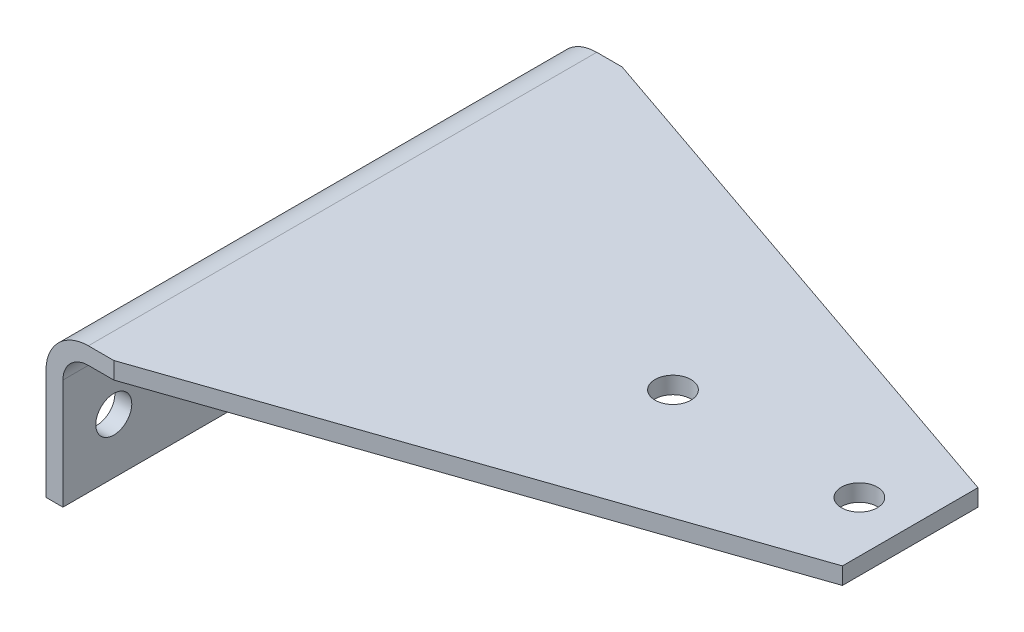
ISO-10303-21;
HEADER;
FILE_DESCRIPTION(('STEP AP214'),'2;1');
FILE_NAME('part.step','',(''),(''),'','','');
FILE_SCHEMA(('AUTOMOTIVE_DESIGN { 1 0 10303 214 1 1 1 1 }'));
ENDSEC;
DATA;
#1=APPLICATION_CONTEXT('core data for automotive mechanical design processes');
#2=APPLICATION_PROTOCOL_DEFINITION('international standard','automotive_design',2000,#1);
#3=PRODUCT_CONTEXT('',#1,'mechanical');
#4=PRODUCT('Part','Part','',(#3));
#5=PRODUCT_RELATED_PRODUCT_CATEGORY('part','',(#4));
#6=PRODUCT_DEFINITION_FORMATION('','',#4);
#7=PRODUCT_DEFINITION_CONTEXT('part definition',#1,'design');
#8=PRODUCT_DEFINITION('design','',#6,#7);
#9=PRODUCT_DEFINITION_SHAPE('','',#8);
#10=(LENGTH_UNIT() NAMED_UNIT(*) SI_UNIT(.MILLI.,.METRE.));
#11=(NAMED_UNIT(*) PLANE_ANGLE_UNIT() SI_UNIT($,.RADIAN.));
#12=(NAMED_UNIT(*) SI_UNIT($,.STERADIAN.) SOLID_ANGLE_UNIT());
#13=UNCERTAINTY_MEASURE_WITH_UNIT(LENGTH_MEASURE(1.E-05),#10,'distance_accuracy_value','');
#14=(GEOMETRIC_REPRESENTATION_CONTEXT(3) GLOBAL_UNCERTAINTY_ASSIGNED_CONTEXT((#13)) GLOBAL_UNIT_ASSIGNED_CONTEXT((#10,
#11,#12)) REPRESENTATION_CONTEXT('',''));
#15=CARTESIAN_POINT('',(0.,0.,0.));
#16=DIRECTION('',(0.,0.,1.));
#17=DIRECTION('',(1.,0.,0.));
#18=AXIS2_PLACEMENT_3D('',#15,#16,#17);
#19=CARTESIAN_POINT('',(6.34999999999998,-57.15,-95.25));
#20=DIRECTION('',(1.,0.,0.));
#21=DIRECTION('',(0.,1.,0.));
#22=AXIS2_PLACEMENT_3D('',#19,#20,#21);
#23=PLANE('',#22);
#24=CARTESIAN_POINT('',(6.34999999999997,-36.5125,-76.2));
#25=DIRECTION('',(1.,0.,0.));
#26=DIRECTION('',(0.,1.,0.));
#27=AXIS2_PLACEMENT_3D('',#24,#25,#26);
#28=CIRCLE('',#27,6.74687500000001);
#29=CARTESIAN_POINT('',(6.34999999999997,-29.765625,-76.2));
#30=VERTEX_POINT('',#29);
#31=EDGE_CURVE('E153',#30,#30,#28,.F.);
#32=ORIENTED_EDGE('',*,*,#31,.T.);
#33=EDGE_LOOP('',(#32));
#34=FACE_BOUND('',#33,.T.);
#35=DIRECTION('',(0.,1.,0.));
#36=VECTOR('',#35,1.);
#37=CARTESIAN_POINT('',(6.34999999999998,-57.15,95.25));
#38=LINE('',#37,#36);
#39=CARTESIAN_POINT('',(6.34999999999998,-57.15,95.25));
#40=VERTEX_POINT('',#39);
#41=CARTESIAN_POINT('',(6.34999999999999,-15.875,95.25));
#42=VERTEX_POINT('',#41);
#43=EDGE_CURVE('E172',#40,#42,#38,.T.);
#44=ORIENTED_EDGE('',*,*,#43,.F.);
#45=DIRECTION('',(0.,0.,1.));
#46=VECTOR('',#45,1.);
#47=CARTESIAN_POINT('',(6.34999999999998,-57.15,-95.25));
#48=LINE('',#47,#46);
#49=CARTESIAN_POINT('',(6.34999999999998,-57.15,-95.25));
#50=VERTEX_POINT('',#49);
#51=EDGE_CURVE('E202',#50,#40,#48,.T.);
#52=ORIENTED_EDGE('',*,*,#51,.F.);
#53=DIRECTION('',(0.,1.,0.));
#54=VECTOR('',#53,1.);
#55=CARTESIAN_POINT('',(6.34999999999998,-57.15,-95.25));
#56=LINE('',#55,#54);
#57=CARTESIAN_POINT('',(6.34999999999999,-15.875,-95.25));
#58=VERTEX_POINT('',#57);
#59=EDGE_CURVE('E192',#50,#58,#56,.T.);
#60=ORIENTED_EDGE('',*,*,#59,.T.);
#61=DIRECTION('',(0.,0.,1.));
#62=VECTOR('',#61,1.);
#63=CARTESIAN_POINT('',(6.34999999999999,-15.875,-95.25));
#64=LINE('',#63,#62);
#65=EDGE_CURVE('E200',#58,#42,#64,.T.);
#66=ORIENTED_EDGE('',*,*,#65,.T.);
#67=EDGE_LOOP('',(#44,#52,#60,#66));
#68=FACE_BOUND('',#67,.T.);
#69=CARTESIAN_POINT('',(6.34999999999997,-36.5125,76.2));
#70=DIRECTION('',(1.,0.,0.));
#71=DIRECTION('',(0.,1.,0.));
#72=AXIS2_PLACEMENT_3D('',#69,#70,#71);
#73=CIRCLE('',#72,6.74687500000001);
#74=CARTESIAN_POINT('',(6.34999999999997,-29.765625,76.2));
#75=VERTEX_POINT('',#74);
#76=EDGE_CURVE('E373',#75,#75,#73,.F.);
#77=ORIENTED_EDGE('',*,*,#76,.T.);
#78=EDGE_LOOP('',(#77));
#79=FACE_BOUND('',#78,.T.);
#80=ADVANCED_FACE('F32',(#34,#68,#79),#23,.T.);
#81=CARTESIAN_POINT('',(0.,-15.875,-95.25));
#82=DIRECTION('',(-1.,0.,0.));
#83=DIRECTION('',(0.,-1.,0.));
#84=AXIS2_PLACEMENT_3D('',#81,#82,#83);
#85=PLANE('',#84);
#86=CARTESIAN_POINT('',(0.,-36.5125,-76.2));
#87=DIRECTION('',(1.,0.,0.));
#88=DIRECTION('',(0.,0.,-1.));
#89=AXIS2_PLACEMENT_3D('',#86,#87,#88);
#90=CIRCLE('',#89,6.74687500000001);
#91=CARTESIAN_POINT('',(0.,-36.5125,-82.946875));
#92=VERTEX_POINT('',#91);
#93=EDGE_CURVE('E378',#92,#92,#90,.T.);
#94=ORIENTED_EDGE('',*,*,#93,.T.);
#95=EDGE_LOOP('',(#94));
#96=FACE_BOUND('',#95,.T.);
#97=DIRECTION('',(0.,-1.,0.));
#98=VECTOR('',#97,1.);
#99=CARTESIAN_POINT('',(0.,-15.875,95.25));
#100=LINE('',#99,#98);
#101=CARTESIAN_POINT('',(0.,-15.875,95.25));
#102=VERTEX_POINT('',#101);
#103=CARTESIAN_POINT('',(0.,-57.15,95.25));
#104=VERTEX_POINT('',#103);
#105=EDGE_CURVE('E166',#102,#104,#100,.T.);
#106=ORIENTED_EDGE('',*,*,#105,.F.);
#107=DIRECTION('',(0.,0.,1.));
#108=VECTOR('',#107,1.);
#109=CARTESIAN_POINT('',(0.,-15.875,-95.25));
#110=LINE('',#109,#108);
#111=CARTESIAN_POINT('',(0.,-15.875,-95.25));
#112=VERTEX_POINT('',#111);
#113=EDGE_CURVE('E133',#112,#102,#110,.T.);
#114=ORIENTED_EDGE('',*,*,#113,.F.);
#115=DIRECTION('',(0.,-1.,0.));
#116=VECTOR('',#115,1.);
#117=CARTESIAN_POINT('',(0.,-15.875,-95.25));
#118=LINE('',#117,#116);
#119=CARTESIAN_POINT('',(0.,-57.15,-95.25));
#120=VERTEX_POINT('',#119);
#121=EDGE_CURVE('E186',#112,#120,#118,.T.);
#122=ORIENTED_EDGE('',*,*,#121,.T.);
#123=DIRECTION('',(0.,0.,1.));
#124=VECTOR('',#123,1.);
#125=CARTESIAN_POINT('',(0.,-57.15,-95.25));
#126=LINE('',#125,#124);
#127=EDGE_CURVE('E204',#120,#104,#126,.T.);
#128=ORIENTED_EDGE('',*,*,#127,.T.);
#129=EDGE_LOOP('',(#106,#114,#122,#128));
#130=FACE_BOUND('',#129,.T.);
#131=CARTESIAN_POINT('',(0.,-36.5125,76.2));
#132=DIRECTION('',(1.,0.,0.));
#133=DIRECTION('',(0.,0.,1.));
#134=AXIS2_PLACEMENT_3D('',#131,#132,#133);
#135=CIRCLE('',#134,6.74687500000001);
#136=CARTESIAN_POINT('',(0.,-36.5125,82.946875));
#137=VERTEX_POINT('',#136);
#138=EDGE_CURVE('E376',#137,#137,#135,.T.);
#139=ORIENTED_EDGE('',*,*,#138,.T.);
#140=EDGE_LOOP('',(#139));
#141=FACE_BOUND('',#140,.T.);
#142=ADVANCED_FACE('F213',(#96,#130,#141),#85,.T.);
#143=CARTESIAN_POINT('',(15.875,-6.35,-95.25));
#144=DIRECTION('',(0.,-1.,0.));
#145=DIRECTION('',(1.,0.,0.));
#146=AXIS2_PLACEMENT_3D('',#143,#144,#145);
#147=PLANE('',#146);
#148=CARTESIAN_POINT('',(209.55,-6.34999999999997,0.));
#149=DIRECTION('',(0.,-1.,0.));
#150=DIRECTION('',(1.,0.,0.));
#151=AXIS2_PLACEMENT_3D('',#148,#149,#150);
#152=CIRCLE('',#151,6.73099999999998);
#153=CARTESIAN_POINT('',(216.281,-6.34999999999997,0.));
#154=VERTEX_POINT('',#153);
#155=EDGE_CURVE('E116',#154,#154,#152,.F.);
#156=ORIENTED_EDGE('',*,*,#155,.T.);
#157=EDGE_LOOP('',(#156));
#158=FACE_BOUND('',#157,.T.);
#159=DIRECTION('',(0.,0.,1.));
#160=VECTOR('',#159,1.);
#161=CARTESIAN_POINT('',(228.6,-6.34999999999999,-95.25));
#162=LINE('',#161,#160);
#163=CARTESIAN_POINT('',(228.6,-6.34999999999997,-25.4));
#164=VERTEX_POINT('',#163);
#165=CARTESIAN_POINT('',(228.6,-6.34999999999997,25.4));
#166=VERTEX_POINT('',#165);
#167=EDGE_CURVE('E140',#164,#166,#162,.T.);
#168=ORIENTED_EDGE('',*,*,#167,.T.);
#169=DIRECTION('',(-0.945686599304867,0.,0.325079768511048));
#170=VECTOR('',#169,1.);
#171=CARTESIAN_POINT('',(75.4457641921397,-6.35,78.046768558952));
#172=LINE('',#171,#170);
#173=CARTESIAN_POINT('',(25.4,-6.34999999999997,95.25));
#174=VERTEX_POINT('',#173);
#175=EDGE_CURVE('E111',#166,#174,#172,.T.);
#176=ORIENTED_EDGE('',*,*,#175,.T.);
#177=DIRECTION('',(1.,0.,0.));
#178=VECTOR('',#177,1.);
#179=CARTESIAN_POINT('',(15.875,-6.35,95.25));
#180=LINE('',#179,#178);
#181=CARTESIAN_POINT('',(15.875,-6.35,95.25));
#182=VERTEX_POINT('',#181);
#183=EDGE_CURVE('E178',#182,#174,#180,.T.);
#184=ORIENTED_EDGE('',*,*,#183,.F.);
#185=DIRECTION('',(0.,0.,1.));
#186=VECTOR('',#185,1.);
#187=CARTESIAN_POINT('',(15.875,-6.35,-95.25));
#188=LINE('',#187,#186);
#189=CARTESIAN_POINT('',(15.875,-6.35,-95.25));
#190=VERTEX_POINT('',#189);
#191=EDGE_CURVE('E198',#190,#182,#188,.T.);
#192=ORIENTED_EDGE('',*,*,#191,.F.);
#193=DIRECTION('',(1.,0.,0.));
#194=VECTOR('',#193,1.);
#195=CARTESIAN_POINT('',(15.875,-6.35,-95.25));
#196=LINE('',#195,#194);
#197=CARTESIAN_POINT('',(25.4,-6.35,-95.25));
#198=VERTEX_POINT('',#197);
#199=EDGE_CURVE('E131',#190,#198,#196,.T.);
#200=ORIENTED_EDGE('',*,*,#199,.T.);
#201=DIRECTION('',(0.945686599304867,0.,0.325079768511048));
#202=VECTOR('',#201,1.);
#203=CARTESIAN_POINT('',(16.8815720524017,-6.35,-98.1782096069869));
#204=LINE('',#203,#202);
#205=EDGE_CURVE('E56',#198,#164,#204,.T.);
#206=ORIENTED_EDGE('',*,*,#205,.T.);
#207=EDGE_LOOP('',(#168,#176,#184,#192,#200,#206));
#208=FACE_BOUND('',#207,.T.);
#209=CARTESIAN_POINT('',(139.7,-6.34999999999997,0.));
#210=DIRECTION('',(0.,-1.,0.));
#211=DIRECTION('',(1.,0.,0.));
#212=AXIS2_PLACEMENT_3D('',#209,#210,#211);
#213=CIRCLE('',#212,6.73099999999998);
#214=CARTESIAN_POINT('',(146.431,-6.34999999999997,0.));
#215=VERTEX_POINT('',#214);
#216=EDGE_CURVE('E143',#215,#215,#213,.F.);
#217=ORIENTED_EDGE('',*,*,#216,.T.);
#218=EDGE_LOOP('',(#217));
#219=FACE_BOUND('',#218,.T.);
#220=ADVANCED_FACE('F235',(#158,#208,#219),#147,.T.);
#221=CARTESIAN_POINT('',(228.6,0.,-95.25));
#222=DIRECTION('',(0.,1.,0.));
#223=DIRECTION('',(-1.,0.,0.));
#224=AXIS2_PLACEMENT_3D('',#221,#222,#223);
#225=PLANE('',#224);
#226=CARTESIAN_POINT('',(209.55,0.,0.));
#227=DIRECTION('',(0.,1.,0.));
#228=DIRECTION('',(-1.,0.,0.));
#229=AXIS2_PLACEMENT_3D('',#226,#227,#228);
#230=CIRCLE('',#229,6.73099999999998);
#231=CARTESIAN_POINT('',(202.819,0.,0.));
#232=VERTEX_POINT('',#231);
#233=EDGE_CURVE('E141',#232,#232,#230,.F.);
#234=ORIENTED_EDGE('',*,*,#233,.T.);
#235=EDGE_LOOP('',(#234));
#236=FACE_BOUND('',#235,.T.);
#237=DIRECTION('',(-1.,0.,0.));
#238=VECTOR('',#237,1.);
#239=CARTESIAN_POINT('',(228.6,0.,95.25));
#240=LINE('',#239,#238);
#241=CARTESIAN_POINT('',(25.4,0.,95.25));
#242=VERTEX_POINT('',#241);
#243=CARTESIAN_POINT('',(15.875,0.,95.25));
#244=VERTEX_POINT('',#243);
#245=EDGE_CURVE('E126',#242,#244,#240,.T.);
#246=ORIENTED_EDGE('',*,*,#245,.F.);
#247=DIRECTION('',(0.945686599304867,0.,-0.325079768511048));
#248=VECTOR('',#247,1.);
#249=CARTESIAN_POINT('',(265.690655021834,0.,12.6500873362446));
#250=LINE('',#249,#248);
#251=CARTESIAN_POINT('',(228.6,0.,25.4));
#252=VERTEX_POINT('',#251);
#253=EDGE_CURVE('E49',#242,#252,#250,.T.);
#254=ORIENTED_EDGE('',*,*,#253,.T.);
#255=DIRECTION('',(0.,0.,1.));
#256=VECTOR('',#255,1.);
#257=CARTESIAN_POINT('',(228.6,0.,-95.25));
#258=LINE('',#257,#256);
#259=CARTESIAN_POINT('',(228.6,0.,-25.4));
#260=VERTEX_POINT('',#259);
#261=EDGE_CURVE('E124',#260,#252,#258,.T.);
#262=ORIENTED_EDGE('',*,*,#261,.F.);
#263=DIRECTION('',(-0.945686599304867,0.,-0.325079768511048));
#264=VECTOR('',#263,1.);
#265=CARTESIAN_POINT('',(207.126462882096,0.,-32.7815283842795));
#266=LINE('',#265,#264);
#267=CARTESIAN_POINT('',(25.4,0.,-95.25));
#268=VERTEX_POINT('',#267);
#269=EDGE_CURVE('E159',#260,#268,#266,.T.);
#270=ORIENTED_EDGE('',*,*,#269,.T.);
#271=DIRECTION('',(-1.,0.,0.));
#272=VECTOR('',#271,1.);
#273=CARTESIAN_POINT('',(228.6,0.,-95.25));
#274=LINE('',#273,#272);
#275=CARTESIAN_POINT('',(15.875,0.,-95.25));
#276=VERTEX_POINT('',#275);
#277=EDGE_CURVE('E181',#268,#276,#274,.T.);
#278=ORIENTED_EDGE('',*,*,#277,.T.);
#279=DIRECTION('',(0.,0.,1.));
#280=VECTOR('',#279,1.);
#281=CARTESIAN_POINT('',(15.875,0.,-95.25));
#282=LINE('',#281,#280);
#283=EDGE_CURVE('E130',#276,#244,#282,.T.);
#284=ORIENTED_EDGE('',*,*,#283,.T.);
#285=EDGE_LOOP('',(#246,#254,#262,#270,#278,#284));
#286=FACE_BOUND('',#285,.T.);
#287=CARTESIAN_POINT('',(139.7,0.,0.));
#288=DIRECTION('',(0.,1.,0.));
#289=DIRECTION('',(-1.,0.,0.));
#290=AXIS2_PLACEMENT_3D('',#287,#288,#289);
#291=CIRCLE('',#290,6.73099999999998);
#292=CARTESIAN_POINT('',(132.969,0.,0.));
#293=VERTEX_POINT('',#292);
#294=EDGE_CURVE('E36',#293,#293,#291,.F.);
#295=ORIENTED_EDGE('',*,*,#294,.T.);
#296=EDGE_LOOP('',(#295));
#297=FACE_BOUND('',#296,.T.);
#298=ADVANCED_FACE('F121',(#236,#286,#297),#225,.T.);
#299=CARTESIAN_POINT('',(228.6,-6.34999999999999,-95.25));
#300=DIRECTION('',(1.,0.,0.));
#301=DIRECTION('',(0.,0.,-1.));
#302=AXIS2_PLACEMENT_3D('',#299,#300,#301);
#303=PLANE('',#302);
#304=ORIENTED_EDGE('',*,*,#261,.T.);
#305=DIRECTION('',(0.,-1.,0.));
#306=VECTOR('',#305,1.);
#307=CARTESIAN_POINT('',(228.6,508.,25.4));
#308=LINE('',#307,#306);
#309=EDGE_CURVE('E108',#252,#166,#308,.T.);
#310=ORIENTED_EDGE('',*,*,#309,.T.);
#311=ORIENTED_EDGE('',*,*,#167,.F.);
#312=DIRECTION('',(0.,-1.,0.));
#313=VECTOR('',#312,1.);
#314=CARTESIAN_POINT('',(228.6,508.,-25.4));
#315=LINE('',#314,#313);
#316=EDGE_CURVE('E129',#260,#164,#315,.T.);
#317=ORIENTED_EDGE('',*,*,#316,.F.);
#318=EDGE_LOOP('',(#304,#310,#311,#317));
#319=FACE_BOUND('',#318,.T.);
#320=ADVANCED_FACE('F34',(#319),#303,.T.);
#321=CARTESIAN_POINT('',(15.875,-15.875,95.25));
#322=DIRECTION('',(0.,0.,1.));
#323=DIRECTION('',(1.,0.,0.));
#324=AXIS2_PLACEMENT_3D('',#321,#322,#323);
#325=PLANE('',#324);
#326=ORIENTED_EDGE('',*,*,#183,.T.);
#327=DIRECTION('',(0.,1.,0.));
#328=VECTOR('',#327,1.);
#329=CARTESIAN_POINT('',(25.4,-15.875,95.25));
#330=LINE('',#329,#328);
#331=EDGE_CURVE('E11',#174,#242,#330,.T.);
#332=ORIENTED_EDGE('',*,*,#331,.T.);
#333=ORIENTED_EDGE('',*,*,#245,.T.);
#334=CARTESIAN_POINT('',(15.875,-15.875,95.25));
#335=DIRECTION('',(0.,0.,1.));
#336=DIRECTION('',(1.,0.,0.));
#337=AXIS2_PLACEMENT_3D('',#334,#335,#336);
#338=CIRCLE('',#337,15.875);
#339=EDGE_CURVE('E163',#244,#102,#338,.T.);
#340=ORIENTED_EDGE('',*,*,#339,.T.);
#341=ORIENTED_EDGE('',*,*,#105,.T.);
#342=DIRECTION('',(1.,0.,0.));
#343=VECTOR('',#342,1.);
#344=CARTESIAN_POINT('',(0.,-57.15,95.25));
#345=LINE('',#344,#343);
#346=EDGE_CURVE('E169',#104,#40,#345,.T.);
#347=ORIENTED_EDGE('',*,*,#346,.T.);
#348=ORIENTED_EDGE('',*,*,#43,.T.);
#349=CARTESIAN_POINT('',(15.875,-15.875,95.25));
#350=DIRECTION('',(0.,0.,-1.));
#351=DIRECTION('',(-1.,0.,0.));
#352=AXIS2_PLACEMENT_3D('',#349,#350,#351);
#353=CIRCLE('',#352,9.525);
#354=EDGE_CURVE('E175',#42,#182,#353,.T.);
#355=ORIENTED_EDGE('',*,*,#354,.T.);
#356=EDGE_LOOP('',(#326,#332,#333,#340,#341,#347,#348,#355));
#357=FACE_BOUND('',#356,.T.);
#358=ADVANCED_FACE('F217',(#357),#325,.T.);
#359=CARTESIAN_POINT('',(15.875,-15.875,-95.25));
#360=DIRECTION('',(0.,0.,1.));
#361=DIRECTION('',(1.,0.,0.));
#362=AXIS2_PLACEMENT_3D('',#359,#360,#361);
#363=PLANE('',#362);
#364=DIRECTION('',(0.,1.,0.));
#365=VECTOR('',#364,1.);
#366=CARTESIAN_POINT('',(25.4,-15.875,-95.25));
#367=LINE('',#366,#365);
#368=EDGE_CURVE('E41',#198,#268,#367,.T.);
#369=ORIENTED_EDGE('',*,*,#368,.F.);
#370=ORIENTED_EDGE('',*,*,#199,.F.);
#371=CARTESIAN_POINT('',(15.875,-15.875,-95.25));
#372=DIRECTION('',(0.,0.,-1.));
#373=DIRECTION('',(-1.,0.,0.));
#374=AXIS2_PLACEMENT_3D('',#371,#372,#373);
#375=CIRCLE('',#374,9.525);
#376=EDGE_CURVE('E136',#58,#190,#375,.T.);
#377=ORIENTED_EDGE('',*,*,#376,.F.);
#378=ORIENTED_EDGE('',*,*,#59,.F.);
#379=DIRECTION('',(1.,0.,0.));
#380=VECTOR('',#379,1.);
#381=CARTESIAN_POINT('',(0.,-57.15,-95.25));
#382=LINE('',#381,#380);
#383=EDGE_CURVE('E189',#120,#50,#382,.T.);
#384=ORIENTED_EDGE('',*,*,#383,.F.);
#385=ORIENTED_EDGE('',*,*,#121,.F.);
#386=CARTESIAN_POINT('',(15.875,-15.875,-95.25));
#387=DIRECTION('',(0.,0.,1.));
#388=DIRECTION('',(1.,0.,0.));
#389=AXIS2_PLACEMENT_3D('',#386,#387,#388);
#390=CIRCLE('',#389,15.875);
#391=EDGE_CURVE('E183',#276,#112,#390,.T.);
#392=ORIENTED_EDGE('',*,*,#391,.F.);
#393=ORIENTED_EDGE('',*,*,#277,.F.);
#394=EDGE_LOOP('',(#369,#370,#377,#378,#384,#385,#392,#393));
#395=FACE_BOUND('',#394,.T.);
#396=ADVANCED_FACE('F220',(#395),#363,.F.);
#397=CARTESIAN_POINT('',(15.875,-15.875,-95.25));
#398=DIRECTION('',(0.,0.,1.));
#399=DIRECTION('',(1.,0.,0.));
#400=AXIS2_PLACEMENT_3D('',#397,#398,#399);
#401=CYLINDRICAL_SURFACE('',#400,9.525);
#402=ORIENTED_EDGE('',*,*,#354,.F.);
#403=ORIENTED_EDGE('',*,*,#65,.F.);
#404=ORIENTED_EDGE('',*,*,#376,.T.);
#405=ORIENTED_EDGE('',*,*,#191,.T.);
#406=EDGE_LOOP('',(#402,#403,#404,#405));
#407=FACE_BOUND('',#406,.T.);
#408=ADVANCED_FACE('F232',(#407),#401,.F.);
#409=CARTESIAN_POINT('',(0.,-57.15,-95.25));
#410=DIRECTION('',(0.,-1.,0.));
#411=DIRECTION('',(0.,0.,-1.));
#412=AXIS2_PLACEMENT_3D('',#409,#410,#411);
#413=PLANE('',#412);
#414=ORIENTED_EDGE('',*,*,#346,.F.);
#415=ORIENTED_EDGE('',*,*,#127,.F.);
#416=ORIENTED_EDGE('',*,*,#383,.T.);
#417=ORIENTED_EDGE('',*,*,#51,.T.);
#418=EDGE_LOOP('',(#414,#415,#416,#417));
#419=FACE_BOUND('',#418,.T.);
#420=ADVANCED_FACE('F225',(#419),#413,.T.);
#421=CARTESIAN_POINT('',(15.875,-15.875,-95.25));
#422=DIRECTION('',(0.,0.,1.));
#423=DIRECTION('',(1.,0.,0.));
#424=AXIS2_PLACEMENT_3D('',#421,#422,#423);
#425=CYLINDRICAL_SURFACE('',#424,15.875);
#426=ORIENTED_EDGE('',*,*,#339,.F.);
#427=ORIENTED_EDGE('',*,*,#283,.F.);
#428=ORIENTED_EDGE('',*,*,#391,.T.);
#429=ORIENTED_EDGE('',*,*,#113,.T.);
#430=EDGE_LOOP('',(#426,#427,#428,#429));
#431=FACE_BOUND('',#430,.T.);
#432=ADVANCED_FACE('F208',(#431),#425,.T.);
#433=CARTESIAN_POINT('',(25.4,508.,-95.25));
#434=DIRECTION('',(0.325079768511048,0.,-0.945686599304867));
#435=DIRECTION('',(-0.945686599304867,0.,-0.325079768511048));
#436=AXIS2_PLACEMENT_3D('',#433,#434,#435);
#437=PLANE('',#436);
#438=ORIENTED_EDGE('',*,*,#368,.T.);
#439=ORIENTED_EDGE('',*,*,#269,.F.);
#440=ORIENTED_EDGE('',*,*,#316,.T.);
#441=ORIENTED_EDGE('',*,*,#205,.F.);
#442=EDGE_LOOP('',(#438,#439,#440,#441));
#443=FACE_BOUND('',#442,.T.);
#444=ADVANCED_FACE('F236',(#443),#437,.T.);
#445=CARTESIAN_POINT('',(25.4,508.,95.25));
#446=DIRECTION('',(0.325079768511048,0.,0.945686599304867));
#447=DIRECTION('',(0.945686599304867,0.,-0.325079768511048));
#448=AXIS2_PLACEMENT_3D('',#445,#446,#447);
#449=PLANE('',#448);
#450=ORIENTED_EDGE('',*,*,#309,.F.);
#451=ORIENTED_EDGE('',*,*,#253,.F.);
#452=ORIENTED_EDGE('',*,*,#331,.F.);
#453=ORIENTED_EDGE('',*,*,#175,.F.);
#454=EDGE_LOOP('',(#450,#451,#452,#453));
#455=FACE_BOUND('',#454,.T.);
#456=ADVANCED_FACE('F109',(#455),#449,.T.);
#457=CARTESIAN_POINT('',(209.55,508.,0.));
#458=DIRECTION('',(0.,-1.,0.));
#459=DIRECTION('',(0.,0.,-1.));
#460=AXIS2_PLACEMENT_3D('',#457,#458,#459);
#461=CYLINDRICAL_SURFACE('',#460,6.73099999999998);
#462=ORIENTED_EDGE('',*,*,#155,.F.);
#463=EDGE_LOOP('',(#462));
#464=FACE_BOUND('',#463,.T.);
#465=ORIENTED_EDGE('',*,*,#233,.F.);
#466=EDGE_LOOP('',(#465));
#467=FACE_BOUND('',#466,.T.);
#468=ADVANCED_FACE('F243',(#464,#467),#461,.F.);
#469=CARTESIAN_POINT('',(139.7,508.,0.));
#470=DIRECTION('',(0.,-1.,0.));
#471=DIRECTION('',(0.,0.,-1.));
#472=AXIS2_PLACEMENT_3D('',#469,#470,#471);
#473=CYLINDRICAL_SURFACE('',#472,6.73099999999998);
#474=ORIENTED_EDGE('',*,*,#216,.F.);
#475=EDGE_LOOP('',(#474));
#476=FACE_BOUND('',#475,.T.);
#477=ORIENTED_EDGE('',*,*,#294,.F.);
#478=EDGE_LOOP('',(#477));
#479=FACE_BOUND('',#478,.T.);
#480=ADVANCED_FACE('F327',(#476,#479),#473,.F.);
#481=CARTESIAN_POINT('',(228.6,-36.5125,-76.2));
#482=DIRECTION('',(-1.,0.,0.));
#483=DIRECTION('',(0.,0.,1.));
#484=AXIS2_PLACEMENT_3D('',#481,#482,#483);
#485=CYLINDRICAL_SURFACE('',#484,6.74687500000001);
#486=ORIENTED_EDGE('',*,*,#31,.F.);
#487=EDGE_LOOP('',(#486));
#488=FACE_BOUND('',#487,.T.);
#489=ORIENTED_EDGE('',*,*,#93,.F.);
#490=EDGE_LOOP('',(#489));
#491=FACE_BOUND('',#490,.T.);
#492=ADVANCED_FACE('F336',(#488,#491),#485,.F.);
#493=CARTESIAN_POINT('',(228.6,-36.5125,76.2));
#494=DIRECTION('',(-1.,0.,0.));
#495=DIRECTION('',(0.,0.,1.));
#496=AXIS2_PLACEMENT_3D('',#493,#494,#495);
#497=CYLINDRICAL_SURFACE('',#496,6.74687500000001);
#498=ORIENTED_EDGE('',*,*,#76,.F.);
#499=EDGE_LOOP('',(#498));
#500=FACE_BOUND('',#499,.T.);
#501=ORIENTED_EDGE('',*,*,#138,.F.);
#502=EDGE_LOOP('',(#501));
#503=FACE_BOUND('',#502,.T.);
#504=ADVANCED_FACE('F354',(#500,#503),#497,.F.);
#505=CLOSED_SHELL('',(#80,#142,#220,#298,#320,#358,#396,#408,#420,#432,#444,#456,#468,#480,#492,#504));
#506=MANIFOLD_SOLID_BREP('B2',#505);
#507=ADVANCED_BREP_SHAPE_REPRESENTATION('',(#18,#506),#14);
#508=SHAPE_DEFINITION_REPRESENTATION(#9,#507);
ENDSEC;
END-ISO-10303-21;
